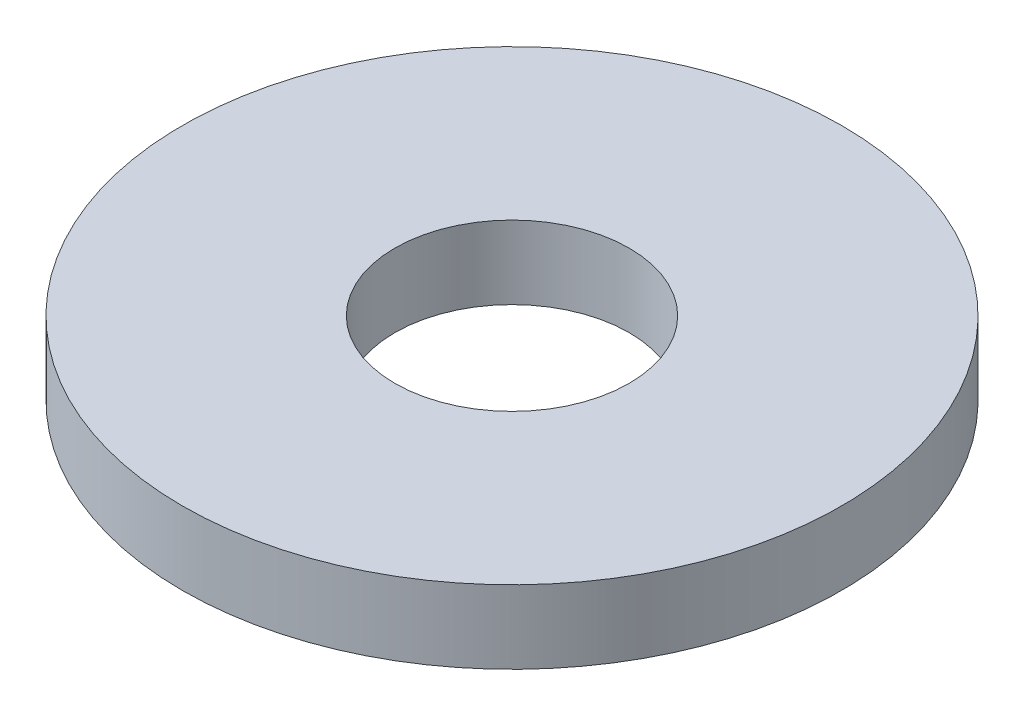
ISO-10303-21;
HEADER;
FILE_DESCRIPTION(('STEP AP214'),'2;1');
FILE_NAME('part.step','',(''),(''),'','','');
FILE_SCHEMA(('AUTOMOTIVE_DESIGN { 1 0 10303 214 1 1 1 1 }'));
ENDSEC;
DATA;
#1=APPLICATION_CONTEXT('core data for automotive mechanical design processes');
#2=APPLICATION_PROTOCOL_DEFINITION('international standard','automotive_design',2000,#1);
#3=PRODUCT_CONTEXT('',#1,'mechanical');
#4=PRODUCT('Part','Part','',(#3));
#5=PRODUCT_RELATED_PRODUCT_CATEGORY('part','',(#4));
#6=PRODUCT_DEFINITION_FORMATION('','',#4);
#7=PRODUCT_DEFINITION_CONTEXT('part definition',#1,'design');
#8=PRODUCT_DEFINITION('design','',#6,#7);
#9=PRODUCT_DEFINITION_SHAPE('','',#8);
#10=(LENGTH_UNIT() NAMED_UNIT(*) SI_UNIT(.MILLI.,.METRE.));
#11=(NAMED_UNIT(*) PLANE_ANGLE_UNIT() SI_UNIT($,.RADIAN.));
#12=(NAMED_UNIT(*) SI_UNIT($,.STERADIAN.) SOLID_ANGLE_UNIT());
#13=UNCERTAINTY_MEASURE_WITH_UNIT(LENGTH_MEASURE(1.E-05),#10,'distance_accuracy_value','');
#14=(GEOMETRIC_REPRESENTATION_CONTEXT(3) GLOBAL_UNCERTAINTY_ASSIGNED_CONTEXT((#13)) GLOBAL_UNIT_ASSIGNED_CONTEXT((#10,
#11,#12)) REPRESENTATION_CONTEXT('',''));
#15=CARTESIAN_POINT('',(0.,0.,0.));
#16=DIRECTION('',(0.,0.,1.));
#17=DIRECTION('',(1.,0.,0.));
#18=AXIS2_PLACEMENT_3D('',#15,#16,#17);
#19=CARTESIAN_POINT('',(0.,0.5,0.));
#20=DIRECTION('',(0.,1.,0.));
#21=DIRECTION('',(0.,0.,1.));
#22=AXIS2_PLACEMENT_3D('',#19,#20,#21);
#23=PLANE('',#22);
#24=CARTESIAN_POINT('',(0.,0.5,0.));
#25=DIRECTION('',(0.,1.,0.));
#26=DIRECTION('',(0.,0.,1.));
#27=AXIS2_PLACEMENT_3D('',#24,#25,#26);
#28=CIRCLE('',#27,4.5);
#29=CARTESIAN_POINT('',(0.,0.5,4.5));
#30=VERTEX_POINT('',#29);
#31=EDGE_CURVE('E10',#30,#30,#28,.T.);
#32=ORIENTED_EDGE('',*,*,#31,.T.);
#33=EDGE_LOOP('',(#32));
#34=FACE_BOUND('',#33,.T.);
#35=CARTESIAN_POINT('',(0.,0.5,0.));
#36=DIRECTION('',(0.,1.,0.));
#37=DIRECTION('',(0.,0.,1.));
#38=AXIS2_PLACEMENT_3D('',#35,#36,#37);
#39=CIRCLE('',#38,1.6);
#40=CARTESIAN_POINT('',(0.,0.5,1.6));
#41=VERTEX_POINT('',#40);
#42=EDGE_CURVE('E46',#41,#41,#39,.T.);
#43=ORIENTED_EDGE('',*,*,#42,.F.);
#44=EDGE_LOOP('',(#43));
#45=FACE_BOUND('',#44,.T.);
#46=ADVANCED_FACE('F35',(#34,#45),#23,.T.);
#47=CARTESIAN_POINT('',(0.,-0.5,0.));
#48=DIRECTION('',(0.,1.,0.));
#49=DIRECTION('',(0.,0.,1.));
#50=AXIS2_PLACEMENT_3D('',#47,#48,#49);
#51=PLANE('',#50);
#52=CARTESIAN_POINT('',(0.,-0.5,0.));
#53=DIRECTION('',(0.,1.,0.));
#54=DIRECTION('',(0.,0.,1.));
#55=AXIS2_PLACEMENT_3D('',#52,#53,#54);
#56=CIRCLE('',#55,4.5);
#57=CARTESIAN_POINT('',(0.,-0.5,4.5));
#58=VERTEX_POINT('',#57);
#59=EDGE_CURVE('E39',#58,#58,#56,.T.);
#60=ORIENTED_EDGE('',*,*,#59,.F.);
#61=EDGE_LOOP('',(#60));
#62=FACE_BOUND('',#61,.T.);
#63=CARTESIAN_POINT('',(0.,-0.5,0.));
#64=DIRECTION('',(0.,1.,0.));
#65=DIRECTION('',(0.,0.,1.));
#66=AXIS2_PLACEMENT_3D('',#63,#64,#65);
#67=CIRCLE('',#66,1.6);
#68=CARTESIAN_POINT('',(0.,-0.5,1.6));
#69=VERTEX_POINT('',#68);
#70=EDGE_CURVE('E48',#69,#69,#67,.T.);
#71=ORIENTED_EDGE('',*,*,#70,.T.);
#72=EDGE_LOOP('',(#71));
#73=FACE_BOUND('',#72,.T.);
#74=ADVANCED_FACE('F58',(#62,#73),#51,.F.);
#75=CARTESIAN_POINT('',(0.,0.5,0.));
#76=DIRECTION('',(0.,-1.,0.));
#77=DIRECTION('',(0.,0.,-1.));
#78=AXIS2_PLACEMENT_3D('',#75,#76,#77);
#79=CYLINDRICAL_SURFACE('',#78,4.5);
#80=ORIENTED_EDGE('',*,*,#31,.F.);
#81=EDGE_LOOP('',(#80));
#82=FACE_BOUND('',#81,.T.);
#83=ORIENTED_EDGE('',*,*,#59,.T.);
#84=EDGE_LOOP('',(#83));
#85=FACE_BOUND('',#84,.T.);
#86=ADVANCED_FACE('F37',(#82,#85),#79,.T.);
#87=CARTESIAN_POINT('',(0.,0.5,0.));
#88=DIRECTION('',(0.,-1.,0.));
#89=DIRECTION('',(0.,0.,-1.));
#90=AXIS2_PLACEMENT_3D('',#87,#88,#89);
#91=CYLINDRICAL_SURFACE('',#90,1.6);
#92=ORIENTED_EDGE('',*,*,#42,.T.);
#93=EDGE_LOOP('',(#92));
#94=FACE_BOUND('',#93,.T.);
#95=ORIENTED_EDGE('',*,*,#70,.F.);
#96=EDGE_LOOP('',(#95));
#97=FACE_BOUND('',#96,.T.);
#98=ADVANCED_FACE('F54',(#94,#97),#91,.F.);
#99=CLOSED_SHELL('',(#46,#74,#86,#98));
#100=MANIFOLD_SOLID_BREP('B2',#99);
#101=ADVANCED_BREP_SHAPE_REPRESENTATION('',(#18,#100),#14);
#102=SHAPE_DEFINITION_REPRESENTATION(#9,#101);
ENDSEC;
END-ISO-10303-21;
